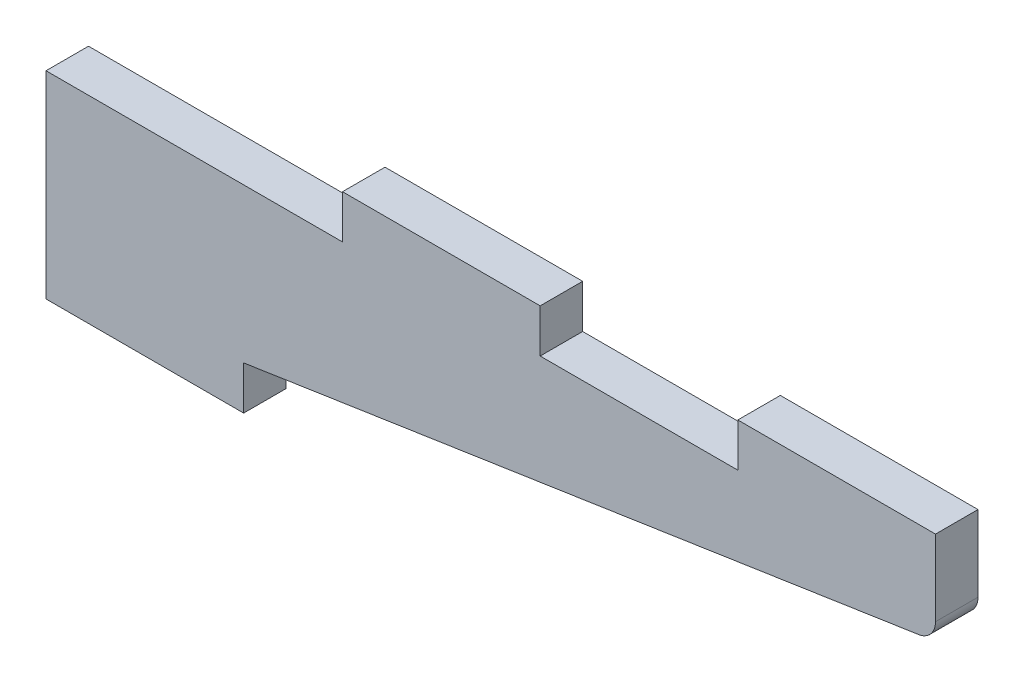
ISO-10303-21;
HEADER;
FILE_DESCRIPTION(('STEP AP214'),'2;1');
FILE_NAME('part.step','',(''),(''),'','','');
FILE_SCHEMA(('AUTOMOTIVE_DESIGN { 1 0 10303 214 1 1 1 1 }'));
ENDSEC;
DATA;
#1=APPLICATION_CONTEXT('core data for automotive mechanical design processes');
#2=APPLICATION_PROTOCOL_DEFINITION('international standard','automotive_design',2000,#1);
#3=PRODUCT_CONTEXT('',#1,'mechanical');
#4=PRODUCT('Part','Part','',(#3));
#5=PRODUCT_RELATED_PRODUCT_CATEGORY('part','',(#4));
#6=PRODUCT_DEFINITION_FORMATION('','',#4);
#7=PRODUCT_DEFINITION_CONTEXT('part definition',#1,'design');
#8=PRODUCT_DEFINITION('design','',#6,#7);
#9=PRODUCT_DEFINITION_SHAPE('','',#8);
#10=(LENGTH_UNIT() NAMED_UNIT(*) SI_UNIT(.MILLI.,.METRE.));
#11=(NAMED_UNIT(*) PLANE_ANGLE_UNIT() SI_UNIT($,.RADIAN.));
#12=(NAMED_UNIT(*) SI_UNIT($,.STERADIAN.) SOLID_ANGLE_UNIT());
#13=UNCERTAINTY_MEASURE_WITH_UNIT(LENGTH_MEASURE(1.E-05),#10,'distance_accuracy_value','');
#14=(GEOMETRIC_REPRESENTATION_CONTEXT(3) GLOBAL_UNCERTAINTY_ASSIGNED_CONTEXT((#13)) GLOBAL_UNIT_ASSIGNED_CONTEXT((#10,
#11,#12)) REPRESENTATION_CONTEXT('',''));
#15=CARTESIAN_POINT('',(0.,0.,0.));
#16=DIRECTION('',(0.,0.,1.));
#17=DIRECTION('',(1.,0.,0.));
#18=AXIS2_PLACEMENT_3D('',#15,#16,#17);
#19=CARTESIAN_POINT('',(0.,0.,5.461));
#20=DIRECTION('',(0.,1.,0.));
#21=DIRECTION('',(0.,0.,1.));
#22=AXIS2_PLACEMENT_3D('',#19,#20,#21);
#23=PLANE('',#22);
#24=DIRECTION('',(1.,0.,0.));
#25=VECTOR('',#24,1.);
#26=CARTESIAN_POINT('',(0.,0.,0.));
#27=LINE('',#26,#25);
#28=CARTESIAN_POINT('',(0.,0.,0.));
#29=VERTEX_POINT('',#28);
#30=CARTESIAN_POINT('',(25.4,0.,0.));
#31=VERTEX_POINT('',#30);
#32=EDGE_CURVE('E152',#29,#31,#27,.T.);
#33=ORIENTED_EDGE('',*,*,#32,.T.);
#34=DIRECTION('',(0.,0.,-1.));
#35=VECTOR('',#34,1.);
#36=CARTESIAN_POINT('',(25.4,0.,5.461));
#37=LINE('',#36,#35);
#38=CARTESIAN_POINT('',(25.4,0.,5.461));
#39=VERTEX_POINT('',#38);
#40=EDGE_CURVE('E134',#39,#31,#37,.T.);
#41=ORIENTED_EDGE('',*,*,#40,.F.);
#42=DIRECTION('',(1.,0.,0.));
#43=VECTOR('',#42,1.);
#44=CARTESIAN_POINT('',(0.,0.,5.461));
#45=LINE('',#44,#43);
#46=CARTESIAN_POINT('',(0.,0.,5.461));
#47=VERTEX_POINT('',#46);
#48=EDGE_CURVE('E140',#47,#39,#45,.T.);
#49=ORIENTED_EDGE('',*,*,#48,.F.);
#50=DIRECTION('',(0.,0.,-1.));
#51=VECTOR('',#50,1.);
#52=CARTESIAN_POINT('',(0.,0.,5.461));
#53=LINE('',#52,#51);
#54=EDGE_CURVE('E184',#47,#29,#53,.T.);
#55=ORIENTED_EDGE('',*,*,#54,.T.);
#56=EDGE_LOOP('',(#33,#41,#49,#55));
#57=FACE_BOUND('',#56,.T.);
#58=ADVANCED_FACE('F35',(#57),#23,.F.);
#59=CARTESIAN_POINT('',(25.4,0.,5.461));
#60=DIRECTION('',(-1.,0.,0.));
#61=DIRECTION('',(0.,0.,1.));
#62=AXIS2_PLACEMENT_3D('',#59,#60,#61);
#63=PLANE('',#62);
#64=DIRECTION('',(0.,1.,0.));
#65=VECTOR('',#64,1.);
#66=CARTESIAN_POINT('',(25.4,0.,0.));
#67=LINE('',#66,#65);
#68=CARTESIAN_POINT('',(25.4,5.588,0.));
#69=VERTEX_POINT('',#68);
#70=EDGE_CURVE('E205',#31,#69,#67,.T.);
#71=ORIENTED_EDGE('',*,*,#70,.T.);
#72=DIRECTION('',(0.,0.,-1.));
#73=VECTOR('',#72,1.);
#74=CARTESIAN_POINT('',(25.4,5.588,5.461));
#75=LINE('',#74,#73);
#76=CARTESIAN_POINT('',(25.4,5.588,5.461));
#77=VERTEX_POINT('',#76);
#78=EDGE_CURVE('E137',#77,#69,#75,.T.);
#79=ORIENTED_EDGE('',*,*,#78,.F.);
#80=DIRECTION('',(0.,1.,0.));
#81=VECTOR('',#80,1.);
#82=CARTESIAN_POINT('',(25.4,0.,5.461));
#83=LINE('',#82,#81);
#84=EDGE_CURVE('E130',#39,#77,#83,.T.);
#85=ORIENTED_EDGE('',*,*,#84,.F.);
#86=ORIENTED_EDGE('',*,*,#40,.T.);
#87=EDGE_LOOP('',(#71,#79,#85,#86));
#88=FACE_BOUND('',#87,.T.);
#89=ADVANCED_FACE('F132',(#88),#63,.F.);
#90=CARTESIAN_POINT('',(25.4,5.588,5.461));
#91=DIRECTION('',(-0.149721695818997,0.988728179936773,0.));
#92=DIRECTION('',(-0.988728179936773,-0.149721695818997,0.));
#93=AXIS2_PLACEMENT_3D('',#90,#91,#92);
#94=PLANE('',#93);
#95=DIRECTION('',(0.988728179936773,0.149721695818997,0.));
#96=VECTOR('',#95,1.);
#97=CARTESIAN_POINT('',(25.4,5.588,0.));
#98=LINE('',#97,#96);
#99=CARTESIAN_POINT('',(112.14029310738,18.7229586705462,0.));
#100=VERTEX_POINT('',#99);
#101=EDGE_CURVE('E203',#69,#100,#98,.T.);
#102=ORIENTED_EDGE('',*,*,#101,.T.);
#103=DIRECTION('',(0.,0.,-1.));
#104=VECTOR('',#103,1.);
#105=CARTESIAN_POINT('',(112.14029310738,18.7229586705462,5.461));
#106=LINE('',#105,#104);
#107=CARTESIAN_POINT('',(112.14029310738,18.7229586705462,5.461));
#108=VERTEX_POINT('',#107);
#109=EDGE_CURVE('E43',#100,#108,#106,.F.);
#110=ORIENTED_EDGE('',*,*,#109,.T.);
#111=DIRECTION('',(0.988728179936773,0.149721695818997,0.));
#112=VECTOR('',#111,1.);
#113=CARTESIAN_POINT('',(25.4,5.588,5.461));
#114=LINE('',#113,#112);
#115=EDGE_CURVE('E139',#77,#108,#114,.T.);
#116=ORIENTED_EDGE('',*,*,#115,.F.);
#117=ORIENTED_EDGE('',*,*,#78,.T.);
#118=EDGE_LOOP('',(#102,#110,#116,#117));
#119=FACE_BOUND('',#118,.T.);
#120=ADVANCED_FACE('F271',(#119),#94,.F.);
#121=CARTESIAN_POINT('',(114.3,30.988,5.461));
#122=DIRECTION('',(-1.,0.,0.));
#123=DIRECTION('',(0.,0.,1.));
#124=AXIS2_PLACEMENT_3D('',#121,#122,#123);
#125=PLANE('',#124);
#126=DIRECTION('',(0.,1.,0.));
#127=VECTOR('',#126,1.);
#128=CARTESIAN_POINT('',(114.3,19.05,5.461));
#129=LINE('',#128,#127);
#130=CARTESIAN_POINT('',(114.3,21.2343282475856,5.461));
#131=VERTEX_POINT('',#130);
#132=CARTESIAN_POINT('',(114.3,30.988,5.461));
#133=VERTEX_POINT('',#132);
#134=EDGE_CURVE('E223',#131,#133,#129,.T.);
#135=ORIENTED_EDGE('',*,*,#134,.F.);
#136=DIRECTION('',(0.,0.,-1.));
#137=VECTOR('',#136,1.);
#138=CARTESIAN_POINT('',(114.3,21.2343282475856,5.461));
#139=LINE('',#138,#137);
#140=CARTESIAN_POINT('',(114.3,21.2343282475856,0.));
#141=VERTEX_POINT('',#140);
#142=EDGE_CURVE('E153',#131,#141,#139,.T.);
#143=ORIENTED_EDGE('',*,*,#142,.T.);
#144=DIRECTION('',(0.,1.,0.));
#145=VECTOR('',#144,1.);
#146=CARTESIAN_POINT('',(114.3,30.988,0.));
#147=LINE('',#146,#145);
#148=CARTESIAN_POINT('',(114.3,30.988,0.));
#149=VERTEX_POINT('',#148);
#150=EDGE_CURVE('E201',#141,#149,#147,.T.);
#151=ORIENTED_EDGE('',*,*,#150,.T.);
#152=DIRECTION('',(0.,0.,-1.));
#153=VECTOR('',#152,1.);
#154=CARTESIAN_POINT('',(114.3,30.988,5.461));
#155=LINE('',#154,#153);
#156=EDGE_CURVE('E157',#133,#149,#155,.T.);
#157=ORIENTED_EDGE('',*,*,#156,.F.);
#158=EDGE_LOOP('',(#135,#143,#151,#157));
#159=FACE_BOUND('',#158,.T.);
#160=ADVANCED_FACE('F230',(#159),#125,.F.);
#161=CARTESIAN_POINT('',(88.9,30.988,5.461));
#162=DIRECTION('',(0.,-1.,0.));
#163=DIRECTION('',(0.,0.,-1.));
#164=AXIS2_PLACEMENT_3D('',#161,#162,#163);
#165=PLANE('',#164);
#166=DIRECTION('',(-1.,0.,0.));
#167=VECTOR('',#166,1.);
#168=CARTESIAN_POINT('',(88.9,30.988,0.));
#169=LINE('',#168,#167);
#170=CARTESIAN_POINT('',(88.9,30.988,0.));
#171=VERTEX_POINT('',#170);
#172=EDGE_CURVE('E199',#149,#171,#169,.T.);
#173=ORIENTED_EDGE('',*,*,#172,.T.);
#174=DIRECTION('',(0.,0.,-1.));
#175=VECTOR('',#174,1.);
#176=CARTESIAN_POINT('',(88.9,30.988,5.461));
#177=LINE('',#176,#175);
#178=CARTESIAN_POINT('',(88.9,30.988,5.461));
#179=VERTEX_POINT('',#178);
#180=EDGE_CURVE('E163',#179,#171,#177,.T.);
#181=ORIENTED_EDGE('',*,*,#180,.F.);
#182=DIRECTION('',(-1.,0.,0.));
#183=VECTOR('',#182,1.);
#184=CARTESIAN_POINT('',(88.9,30.988,5.461));
#185=LINE('',#184,#183);
#186=EDGE_CURVE('E221',#133,#179,#185,.T.);
#187=ORIENTED_EDGE('',*,*,#186,.F.);
#188=ORIENTED_EDGE('',*,*,#156,.T.);
#189=EDGE_LOOP('',(#173,#181,#187,#188));
#190=FACE_BOUND('',#189,.T.);
#191=ADVANCED_FACE('F238',(#190),#165,.F.);
#192=CARTESIAN_POINT('',(88.9,25.4,5.461));
#193=DIRECTION('',(1.,0.,0.));
#194=DIRECTION('',(0.,0.,-1.));
#195=AXIS2_PLACEMENT_3D('',#192,#193,#194);
#196=PLANE('',#195);
#197=DIRECTION('',(0.,-1.,0.));
#198=VECTOR('',#197,1.);
#199=CARTESIAN_POINT('',(88.9,25.4,0.));
#200=LINE('',#199,#198);
#201=CARTESIAN_POINT('',(88.9,25.4,0.));
#202=VERTEX_POINT('',#201);
#203=EDGE_CURVE('E197',#171,#202,#200,.T.);
#204=ORIENTED_EDGE('',*,*,#203,.T.);
#205=DIRECTION('',(0.,0.,-1.));
#206=VECTOR('',#205,1.);
#207=CARTESIAN_POINT('',(88.9,25.4,5.461));
#208=LINE('',#207,#206);
#209=CARTESIAN_POINT('',(88.9,25.4,5.461));
#210=VERTEX_POINT('',#209);
#211=EDGE_CURVE('E166',#210,#202,#208,.T.);
#212=ORIENTED_EDGE('',*,*,#211,.F.);
#213=DIRECTION('',(0.,-1.,0.));
#214=VECTOR('',#213,1.);
#215=CARTESIAN_POINT('',(88.9,25.4,5.461));
#216=LINE('',#215,#214);
#217=EDGE_CURVE('E219',#179,#210,#216,.T.);
#218=ORIENTED_EDGE('',*,*,#217,.F.);
#219=ORIENTED_EDGE('',*,*,#180,.T.);
#220=EDGE_LOOP('',(#204,#212,#218,#219));
#221=FACE_BOUND('',#220,.T.);
#222=ADVANCED_FACE('F242',(#221),#196,.F.);
#223=CARTESIAN_POINT('',(63.5,25.4,5.461));
#224=DIRECTION('',(0.,-1.,0.));
#225=DIRECTION('',(0.,0.,-1.));
#226=AXIS2_PLACEMENT_3D('',#223,#224,#225);
#227=PLANE('',#226);
#228=DIRECTION('',(-1.,0.,0.));
#229=VECTOR('',#228,1.);
#230=CARTESIAN_POINT('',(63.5,25.4,0.));
#231=LINE('',#230,#229);
#232=CARTESIAN_POINT('',(63.5,25.4,0.));
#233=VERTEX_POINT('',#232);
#234=EDGE_CURVE('E195',#202,#233,#231,.T.);
#235=ORIENTED_EDGE('',*,*,#234,.T.);
#236=DIRECTION('',(0.,0.,-1.));
#237=VECTOR('',#236,1.);
#238=CARTESIAN_POINT('',(63.5,25.4,5.461));
#239=LINE('',#238,#237);
#240=CARTESIAN_POINT('',(63.5,25.4,5.461));
#241=VERTEX_POINT('',#240);
#242=EDGE_CURVE('E169',#241,#233,#239,.T.);
#243=ORIENTED_EDGE('',*,*,#242,.F.);
#244=DIRECTION('',(-1.,0.,0.));
#245=VECTOR('',#244,1.);
#246=CARTESIAN_POINT('',(63.5,25.4,5.461));
#247=LINE('',#246,#245);
#248=EDGE_CURVE('E217',#210,#241,#247,.T.);
#249=ORIENTED_EDGE('',*,*,#248,.F.);
#250=ORIENTED_EDGE('',*,*,#211,.T.);
#251=EDGE_LOOP('',(#235,#243,#249,#250));
#252=FACE_BOUND('',#251,.T.);
#253=ADVANCED_FACE('F249',(#252),#227,.F.);
#254=CARTESIAN_POINT('',(63.5,30.988,5.461));
#255=DIRECTION('',(-1.,0.,0.));
#256=DIRECTION('',(0.,0.,1.));
#257=AXIS2_PLACEMENT_3D('',#254,#255,#256);
#258=PLANE('',#257);
#259=DIRECTION('',(0.,1.,0.));
#260=VECTOR('',#259,1.);
#261=CARTESIAN_POINT('',(63.5,30.988,0.));
#262=LINE('',#261,#260);
#263=CARTESIAN_POINT('',(63.5,30.988,0.));
#264=VERTEX_POINT('',#263);
#265=EDGE_CURVE('E193',#233,#264,#262,.T.);
#266=ORIENTED_EDGE('',*,*,#265,.T.);
#267=DIRECTION('',(0.,0.,-1.));
#268=VECTOR('',#267,1.);
#269=CARTESIAN_POINT('',(63.5,30.988,5.461));
#270=LINE('',#269,#268);
#271=CARTESIAN_POINT('',(63.5,30.988,5.461));
#272=VERTEX_POINT('',#271);
#273=EDGE_CURVE('E172',#272,#264,#270,.T.);
#274=ORIENTED_EDGE('',*,*,#273,.F.);
#275=DIRECTION('',(0.,1.,0.));
#276=VECTOR('',#275,1.);
#277=CARTESIAN_POINT('',(63.5,30.988,5.461));
#278=LINE('',#277,#276);
#279=EDGE_CURVE('E215',#241,#272,#278,.T.);
#280=ORIENTED_EDGE('',*,*,#279,.F.);
#281=ORIENTED_EDGE('',*,*,#242,.T.);
#282=EDGE_LOOP('',(#266,#274,#280,#281));
#283=FACE_BOUND('',#282,.T.);
#284=ADVANCED_FACE('F252',(#283),#258,.F.);
#285=CARTESIAN_POINT('',(38.1,30.988,5.461));
#286=DIRECTION('',(0.,-1.,0.));
#287=DIRECTION('',(0.,0.,-1.));
#288=AXIS2_PLACEMENT_3D('',#285,#286,#287);
#289=PLANE('',#288);
#290=DIRECTION('',(-1.,0.,0.));
#291=VECTOR('',#290,1.);
#292=CARTESIAN_POINT('',(38.1,30.988,0.));
#293=LINE('',#292,#291);
#294=CARTESIAN_POINT('',(38.1,30.988,0.));
#295=VERTEX_POINT('',#294);
#296=EDGE_CURVE('E191',#264,#295,#293,.T.);
#297=ORIENTED_EDGE('',*,*,#296,.T.);
#298=DIRECTION('',(0.,0.,-1.));
#299=VECTOR('',#298,1.);
#300=CARTESIAN_POINT('',(38.1,30.988,5.461));
#301=LINE('',#300,#299);
#302=CARTESIAN_POINT('',(38.1,30.988,5.461));
#303=VERTEX_POINT('',#302);
#304=EDGE_CURVE('E175',#303,#295,#301,.T.);
#305=ORIENTED_EDGE('',*,*,#304,.F.);
#306=DIRECTION('',(-1.,0.,0.));
#307=VECTOR('',#306,1.);
#308=CARTESIAN_POINT('',(38.1,30.988,5.461));
#309=LINE('',#308,#307);
#310=EDGE_CURVE('E213',#272,#303,#309,.T.);
#311=ORIENTED_EDGE('',*,*,#310,.F.);
#312=ORIENTED_EDGE('',*,*,#273,.T.);
#313=EDGE_LOOP('',(#297,#305,#311,#312));
#314=FACE_BOUND('',#313,.T.);
#315=ADVANCED_FACE('F257',(#314),#289,.F.);
#316=CARTESIAN_POINT('',(38.1,25.4,5.461));
#317=DIRECTION('',(1.,0.,0.));
#318=DIRECTION('',(0.,0.,-1.));
#319=AXIS2_PLACEMENT_3D('',#316,#317,#318);
#320=PLANE('',#319);
#321=DIRECTION('',(0.,-1.,0.));
#322=VECTOR('',#321,1.);
#323=CARTESIAN_POINT('',(38.1,25.4,0.));
#324=LINE('',#323,#322);
#325=CARTESIAN_POINT('',(38.1,25.4,0.));
#326=VERTEX_POINT('',#325);
#327=EDGE_CURVE('E189',#295,#326,#324,.T.);
#328=ORIENTED_EDGE('',*,*,#327,.T.);
#329=DIRECTION('',(0.,0.,-1.));
#330=VECTOR('',#329,1.);
#331=CARTESIAN_POINT('',(38.1,25.4,5.461));
#332=LINE('',#331,#330);
#333=CARTESIAN_POINT('',(38.1,25.4,5.461));
#334=VERTEX_POINT('',#333);
#335=EDGE_CURVE('E178',#334,#326,#332,.T.);
#336=ORIENTED_EDGE('',*,*,#335,.F.);
#337=DIRECTION('',(0.,-1.,0.));
#338=VECTOR('',#337,1.);
#339=CARTESIAN_POINT('',(38.1,25.4,5.461));
#340=LINE('',#339,#338);
#341=EDGE_CURVE('E211',#303,#334,#340,.T.);
#342=ORIENTED_EDGE('',*,*,#341,.F.);
#343=ORIENTED_EDGE('',*,*,#304,.T.);
#344=EDGE_LOOP('',(#328,#336,#342,#343));
#345=FACE_BOUND('',#344,.T.);
#346=ADVANCED_FACE('F263',(#345),#320,.F.);
#347=CARTESIAN_POINT('',(0.,25.4,5.461));
#348=DIRECTION('',(0.,-1.,0.));
#349=DIRECTION('',(0.,0.,-1.));
#350=AXIS2_PLACEMENT_3D('',#347,#348,#349);
#351=PLANE('',#350);
#352=DIRECTION('',(-1.,0.,0.));
#353=VECTOR('',#352,1.);
#354=CARTESIAN_POINT('',(0.,25.4,0.));
#355=LINE('',#354,#353);
#356=CARTESIAN_POINT('',(0.,25.4,0.));
#357=VERTEX_POINT('',#356);
#358=EDGE_CURVE('E187',#326,#357,#355,.T.);
#359=ORIENTED_EDGE('',*,*,#358,.T.);
#360=DIRECTION('',(0.,0.,-1.));
#361=VECTOR('',#360,1.);
#362=CARTESIAN_POINT('',(0.,25.4,5.461));
#363=LINE('',#362,#361);
#364=CARTESIAN_POINT('',(0.,25.4,5.461));
#365=VERTEX_POINT('',#364);
#366=EDGE_CURVE('E181',#365,#357,#363,.T.);
#367=ORIENTED_EDGE('',*,*,#366,.F.);
#368=DIRECTION('',(-1.,0.,0.));
#369=VECTOR('',#368,1.);
#370=CARTESIAN_POINT('',(0.,25.4,5.461));
#371=LINE('',#370,#369);
#372=EDGE_CURVE('E209',#334,#365,#371,.T.);
#373=ORIENTED_EDGE('',*,*,#372,.F.);
#374=ORIENTED_EDGE('',*,*,#335,.T.);
#375=EDGE_LOOP('',(#359,#367,#373,#374));
#376=FACE_BOUND('',#375,.T.);
#377=ADVANCED_FACE('F267',(#376),#351,.F.);
#378=CARTESIAN_POINT('',(0.,0.,5.461));
#379=DIRECTION('',(1.,0.,0.));
#380=DIRECTION('',(0.,0.,-1.));
#381=AXIS2_PLACEMENT_3D('',#378,#379,#380);
#382=PLANE('',#381);
#383=DIRECTION('',(0.,-1.,0.));
#384=VECTOR('',#383,1.);
#385=CARTESIAN_POINT('',(0.,0.,0.));
#386=LINE('',#385,#384);
#387=EDGE_CURVE('E149',#357,#29,#386,.T.);
#388=ORIENTED_EDGE('',*,*,#387,.T.);
#389=ORIENTED_EDGE('',*,*,#54,.F.);
#390=DIRECTION('',(0.,-1.,0.));
#391=VECTOR('',#390,1.);
#392=CARTESIAN_POINT('',(0.,0.,5.461));
#393=LINE('',#392,#391);
#394=EDGE_CURVE('E145',#365,#47,#393,.T.);
#395=ORIENTED_EDGE('',*,*,#394,.F.);
#396=ORIENTED_EDGE('',*,*,#366,.T.);
#397=EDGE_LOOP('',(#388,#389,#395,#396));
#398=FACE_BOUND('',#397,.T.);
#399=ADVANCED_FACE('F270',(#398),#382,.F.);
#400=CARTESIAN_POINT('',(0.,0.,5.461));
#401=DIRECTION('',(0.,0.,1.));
#402=DIRECTION('',(1.,0.,0.));
#403=AXIS2_PLACEMENT_3D('',#400,#401,#402);
#404=PLANE('',#403);
#405=ORIENTED_EDGE('',*,*,#115,.T.);
#406=CARTESIAN_POINT('',(111.76,21.2343282475856,5.461));
#407=DIRECTION('',(0.,0.,1.));
#408=DIRECTION('',(1.,0.,0.));
#409=AXIS2_PLACEMENT_3D('',#406,#407,#408);
#410=CIRCLE('',#409,2.54);
#411=EDGE_CURVE('E11',#108,#131,#410,.T.);
#412=ORIENTED_EDGE('',*,*,#411,.T.);
#413=ORIENTED_EDGE('',*,*,#134,.T.);
#414=ORIENTED_EDGE('',*,*,#186,.T.);
#415=ORIENTED_EDGE('',*,*,#217,.T.);
#416=ORIENTED_EDGE('',*,*,#248,.T.);
#417=ORIENTED_EDGE('',*,*,#279,.T.);
#418=ORIENTED_EDGE('',*,*,#310,.T.);
#419=ORIENTED_EDGE('',*,*,#341,.T.);
#420=ORIENTED_EDGE('',*,*,#372,.T.);
#421=ORIENTED_EDGE('',*,*,#394,.T.);
#422=ORIENTED_EDGE('',*,*,#48,.T.);
#423=ORIENTED_EDGE('',*,*,#84,.T.);
#424=EDGE_LOOP('',(#405,#412,#413,#414,#415,#416,#417,#418,#419,#420,#421,#422,#423));
#425=FACE_BOUND('',#424,.T.);
#426=ADVANCED_FACE('F143',(#425),#404,.T.);
#427=CARTESIAN_POINT('',(0.,0.,0.));
#428=DIRECTION('',(0.,0.,1.));
#429=DIRECTION('',(1.,0.,0.));
#430=AXIS2_PLACEMENT_3D('',#427,#428,#429);
#431=PLANE('',#430);
#432=ORIENTED_EDGE('',*,*,#150,.F.);
#433=CARTESIAN_POINT('',(111.76,21.2343282475856,0.));
#434=DIRECTION('',(0.,0.,1.));
#435=DIRECTION('',(1.,0.,0.));
#436=AXIS2_PLACEMENT_3D('',#433,#434,#435);
#437=CIRCLE('',#436,2.54);
#438=EDGE_CURVE('E57',#141,#100,#437,.F.);
#439=ORIENTED_EDGE('',*,*,#438,.T.);
#440=ORIENTED_EDGE('',*,*,#101,.F.);
#441=ORIENTED_EDGE('',*,*,#70,.F.);
#442=ORIENTED_EDGE('',*,*,#32,.F.);
#443=ORIENTED_EDGE('',*,*,#387,.F.);
#444=ORIENTED_EDGE('',*,*,#358,.F.);
#445=ORIENTED_EDGE('',*,*,#327,.F.);
#446=ORIENTED_EDGE('',*,*,#296,.F.);
#447=ORIENTED_EDGE('',*,*,#265,.F.);
#448=ORIENTED_EDGE('',*,*,#234,.F.);
#449=ORIENTED_EDGE('',*,*,#203,.F.);
#450=ORIENTED_EDGE('',*,*,#172,.F.);
#451=EDGE_LOOP('',(#432,#439,#440,#441,#442,#443,#444,#445,#446,#447,#448,#449,#450));
#452=FACE_BOUND('',#451,.T.);
#453=ADVANCED_FACE('F233',(#452),#431,.F.);
#454=CARTESIAN_POINT('',(111.76,21.2343282475856,5.461));
#455=DIRECTION('',(0.,0.,-1.));
#456=DIRECTION('',(-1.,0.,0.));
#457=AXIS2_PLACEMENT_3D('',#454,#455,#456);
#458=CYLINDRICAL_SURFACE('',#457,2.54);
#459=ORIENTED_EDGE('',*,*,#411,.F.);
#460=ORIENTED_EDGE('',*,*,#109,.F.);
#461=ORIENTED_EDGE('',*,*,#438,.F.);
#462=ORIENTED_EDGE('',*,*,#142,.F.);
#463=EDGE_LOOP('',(#459,#460,#461,#462));
#464=FACE_BOUND('',#463,.T.);
#465=ADVANCED_FACE('F37',(#464),#458,.T.);
#466=CLOSED_SHELL('',(#58,#89,#120,#160,#191,#222,#253,#284,#315,#346,#377,#399,#426,#453,#465));
#467=MANIFOLD_SOLID_BREP('B2',#466);
#468=ADVANCED_BREP_SHAPE_REPRESENTATION('',(#18,#467),#14);
#469=SHAPE_DEFINITION_REPRESENTATION(#9,#468);
ENDSEC;
END-ISO-10303-21;
